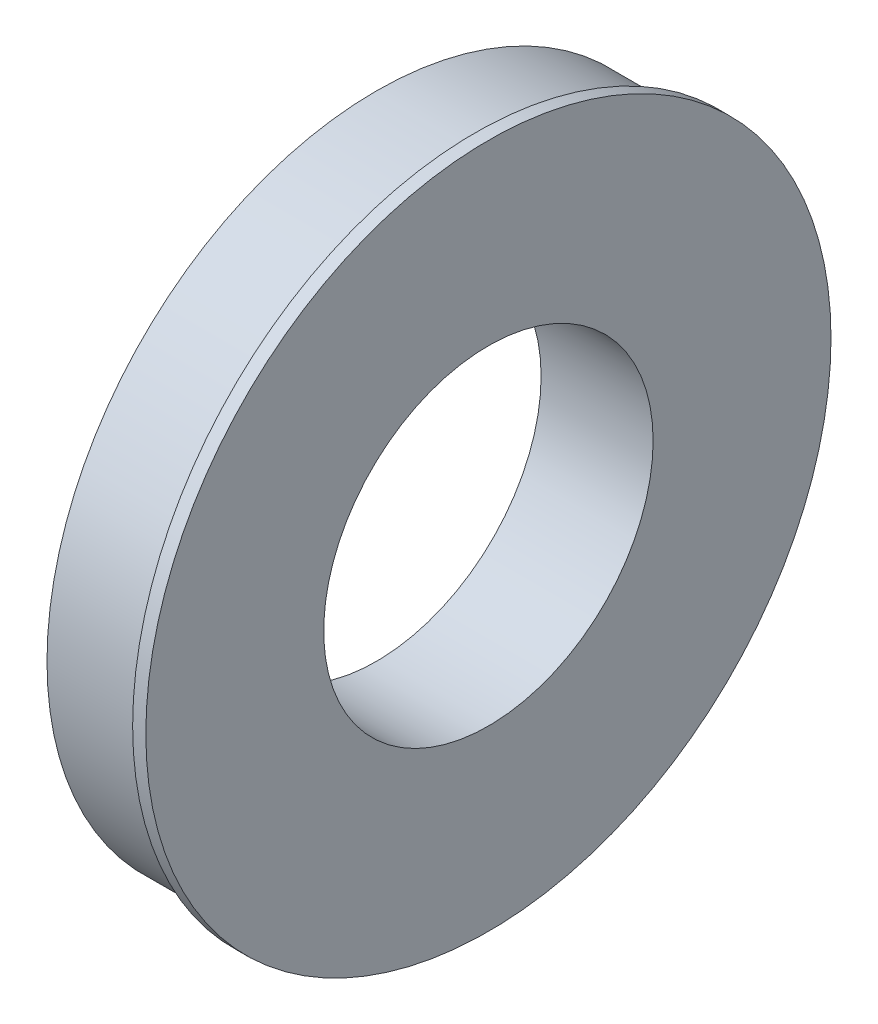
ISO-10303-21;
HEADER;
FILE_DESCRIPTION(('STEP AP214'),'2;1');
FILE_NAME('part.step','',(''),(''),'','','');
FILE_SCHEMA(('AUTOMOTIVE_DESIGN { 1 0 10303 214 1 1 1 1 }'));
ENDSEC;
DATA;
#1=APPLICATION_CONTEXT('core data for automotive mechanical design processes');
#2=APPLICATION_PROTOCOL_DEFINITION('international standard','automotive_design',2000,#1);
#3=PRODUCT_CONTEXT('',#1,'mechanical');
#4=PRODUCT('Part','Part','',(#3));
#5=PRODUCT_RELATED_PRODUCT_CATEGORY('part','',(#4));
#6=PRODUCT_DEFINITION_FORMATION('','',#4);
#7=PRODUCT_DEFINITION_CONTEXT('part definition',#1,'design');
#8=PRODUCT_DEFINITION('design','',#6,#7);
#9=PRODUCT_DEFINITION_SHAPE('','',#8);
#10=(LENGTH_UNIT() NAMED_UNIT(*) SI_UNIT(.MILLI.,.METRE.));
#11=(NAMED_UNIT(*) PLANE_ANGLE_UNIT() SI_UNIT($,.RADIAN.));
#12=(NAMED_UNIT(*) SI_UNIT($,.STERADIAN.) SOLID_ANGLE_UNIT());
#13=UNCERTAINTY_MEASURE_WITH_UNIT(LENGTH_MEASURE(1.E-05),#10,'distance_accuracy_value','');
#14=(GEOMETRIC_REPRESENTATION_CONTEXT(3) GLOBAL_UNCERTAINTY_ASSIGNED_CONTEXT((#13)) GLOBAL_UNIT_ASSIGNED_CONTEXT((#10,
#11,#12)) REPRESENTATION_CONTEXT('',''));
#15=CARTESIAN_POINT('',(0.,0.,0.));
#16=DIRECTION('',(0.,0.,1.));
#17=DIRECTION('',(1.,0.,0.));
#18=AXIS2_PLACEMENT_3D('',#15,#16,#17);
#19=CARTESIAN_POINT('',(0.,0.,0.));
#20=DIRECTION('',(1.,0.,0.));
#21=DIRECTION('',(0.,0.,-1.));
#22=AXIS2_PLACEMENT_3D('',#19,#20,#21);
#23=PLANE('',#22);
#24=CARTESIAN_POINT('',(0.,0.,0.));
#25=DIRECTION('',(1.,0.,0.));
#26=DIRECTION('',(0.,0.,-1.));
#27=AXIS2_PLACEMENT_3D('',#24,#25,#26);
#28=CIRCLE('',#27,63.5);
#29=CARTESIAN_POINT('',(0.,0.,-63.5));
#30=VERTEX_POINT('',#29);
#31=EDGE_CURVE('E36',#30,#30,#28,.T.);
#32=ORIENTED_EDGE('',*,*,#31,.F.);
#33=EDGE_LOOP('',(#32));
#34=FACE_BOUND('',#33,.T.);
#35=CARTESIAN_POINT('',(0.,0.,0.));
#36=DIRECTION('',(1.,0.,0.));
#37=DIRECTION('',(0.,0.,-1.));
#38=AXIS2_PLACEMENT_3D('',#35,#36,#37);
#39=CIRCLE('',#38,31.75);
#40=CARTESIAN_POINT('',(0.,0.,-31.75));
#41=VERTEX_POINT('',#40);
#42=EDGE_CURVE('E43',#41,#41,#39,.T.);
#43=ORIENTED_EDGE('',*,*,#42,.T.);
#44=EDGE_LOOP('',(#43));
#45=FACE_BOUND('',#44,.T.);
#46=ADVANCED_FACE('F32',(#34,#45),#23,.F.);
#47=CARTESIAN_POINT('',(19.05,0.,0.));
#48=DIRECTION('',(-1.,0.,0.));
#49=DIRECTION('',(0.,0.,1.));
#50=AXIS2_PLACEMENT_3D('',#47,#48,#49);
#51=CYLINDRICAL_SURFACE('',#50,63.5);
#52=CARTESIAN_POINT('',(19.05,0.,0.));
#53=DIRECTION('',(1.,0.,0.));
#54=DIRECTION('',(0.,0.,-1.));
#55=AXIS2_PLACEMENT_3D('',#52,#53,#54);
#56=CIRCLE('',#55,63.5);
#57=CARTESIAN_POINT('',(19.05,0.,-63.5));
#58=VERTEX_POINT('',#57);
#59=EDGE_CURVE('E10',#58,#58,#56,.T.);
#60=ORIENTED_EDGE('',*,*,#59,.F.);
#61=EDGE_LOOP('',(#60));
#62=FACE_BOUND('',#61,.T.);
#63=ORIENTED_EDGE('',*,*,#31,.T.);
#64=EDGE_LOOP('',(#63));
#65=FACE_BOUND('',#64,.T.);
#66=ADVANCED_FACE('F34',(#62,#65),#51,.T.);
#67=CARTESIAN_POINT('',(19.05,0.,0.));
#68=DIRECTION('',(-1.,0.,0.));
#69=DIRECTION('',(0.,0.,1.));
#70=AXIS2_PLACEMENT_3D('',#67,#68,#69);
#71=CYLINDRICAL_SURFACE('',#70,31.75);
#72=ORIENTED_EDGE('',*,*,#42,.F.);
#73=EDGE_LOOP('',(#72));
#74=FACE_BOUND('',#73,.T.);
#75=CARTESIAN_POINT('',(21.59,0.,0.));
#76=DIRECTION('',(1.,0.,0.));
#77=DIRECTION('',(0.,0.,-1.));
#78=AXIS2_PLACEMENT_3D('',#75,#76,#77);
#79=CIRCLE('',#78,31.75);
#80=CARTESIAN_POINT('',(21.59,0.,-31.75));
#81=VERTEX_POINT('',#80);
#82=EDGE_CURVE('E51',#81,#81,#79,.T.);
#83=ORIENTED_EDGE('',*,*,#82,.T.);
#84=EDGE_LOOP('',(#83));
#85=FACE_BOUND('',#84,.T.);
#86=ADVANCED_FACE('F57',(#74,#85),#71,.F.);
#87=CARTESIAN_POINT('',(21.59,0.,0.));
#88=DIRECTION('',(1.,0.,0.));
#89=DIRECTION('',(0.,0.,-1.));
#90=AXIS2_PLACEMENT_3D('',#87,#88,#89);
#91=PLANE('',#90);
#92=CARTESIAN_POINT('',(21.59,0.,0.));
#93=DIRECTION('',(1.,0.,0.));
#94=DIRECTION('',(0.,0.,-1.));
#95=AXIS2_PLACEMENT_3D('',#92,#93,#94);
#96=CIRCLE('',#95,66.04);
#97=CARTESIAN_POINT('',(21.59,0.,-66.04));
#98=VERTEX_POINT('',#97);
#99=EDGE_CURVE('E47',#98,#98,#96,.T.);
#100=ORIENTED_EDGE('',*,*,#99,.T.);
#101=EDGE_LOOP('',(#100));
#102=FACE_BOUND('',#101,.T.);
#103=ORIENTED_EDGE('',*,*,#82,.F.);
#104=EDGE_LOOP('',(#103));
#105=FACE_BOUND('',#104,.T.);
#106=ADVANCED_FACE('F59',(#102,#105),#91,.T.);
#107=CARTESIAN_POINT('',(19.05,0.,0.));
#108=DIRECTION('',(1.,0.,0.));
#109=DIRECTION('',(0.,0.,-1.));
#110=AXIS2_PLACEMENT_3D('',#107,#108,#109);
#111=PLANE('',#110);
#112=ORIENTED_EDGE('',*,*,#59,.T.);
#113=EDGE_LOOP('',(#112));
#114=FACE_BOUND('',#113,.T.);
#115=CARTESIAN_POINT('',(19.05,0.,0.));
#116=DIRECTION('',(1.,0.,0.));
#117=DIRECTION('',(0.,0.,-1.));
#118=AXIS2_PLACEMENT_3D('',#115,#116,#117);
#119=CIRCLE('',#118,66.04);
#120=CARTESIAN_POINT('',(19.05,0.,-66.04));
#121=VERTEX_POINT('',#120);
#122=EDGE_CURVE('E48',#121,#121,#119,.T.);
#123=ORIENTED_EDGE('',*,*,#122,.F.);
#124=EDGE_LOOP('',(#123));
#125=FACE_BOUND('',#124,.T.);
#126=ADVANCED_FACE('F61',(#114,#125),#111,.F.);
#127=CARTESIAN_POINT('',(21.59,0.,0.));
#128=DIRECTION('',(-1.,0.,0.));
#129=DIRECTION('',(0.,0.,1.));
#130=AXIS2_PLACEMENT_3D('',#127,#128,#129);
#131=CYLINDRICAL_SURFACE('',#130,66.04);
#132=ORIENTED_EDGE('',*,*,#99,.F.);
#133=EDGE_LOOP('',(#132));
#134=FACE_BOUND('',#133,.T.);
#135=ORIENTED_EDGE('',*,*,#122,.T.);
#136=EDGE_LOOP('',(#135));
#137=FACE_BOUND('',#136,.T.);
#138=ADVANCED_FACE('F68',(#134,#137),#131,.T.);
#139=CLOSED_SHELL('',(#46,#66,#86,#106,#126,#138));
#140=MANIFOLD_SOLID_BREP('B2',#139);
#141=ADVANCED_BREP_SHAPE_REPRESENTATION('',(#18,#140),#14);
#142=SHAPE_DEFINITION_REPRESENTATION(#9,#141);
ENDSEC;
END-ISO-10303-21;
